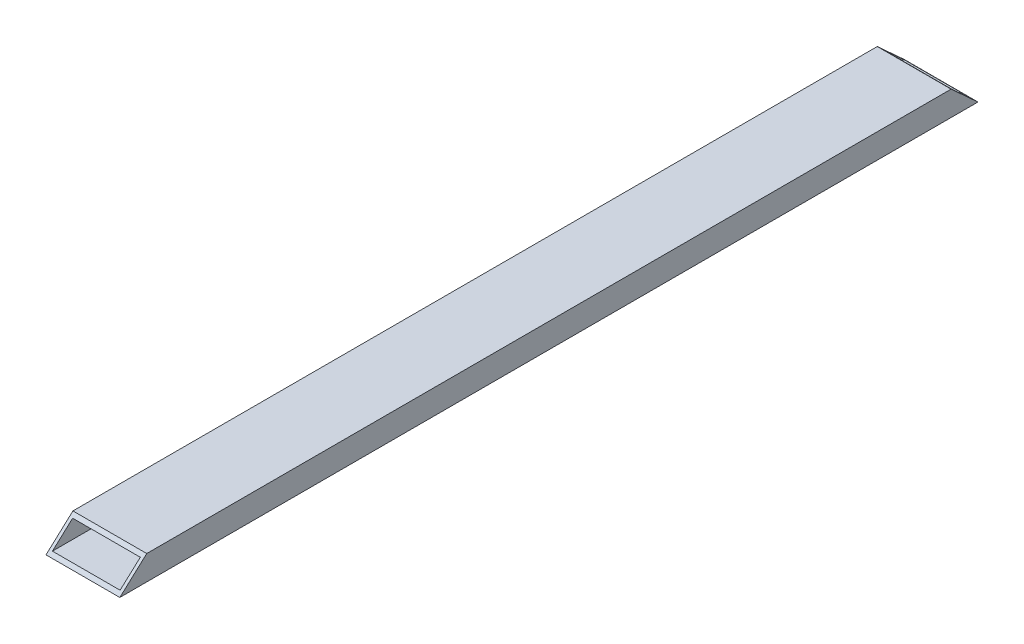
ISO-10303-21;
HEADER;
FILE_DESCRIPTION(('STEP AP214'),'2;1');
FILE_NAME('part.step','',(''),(''),'','','');
FILE_SCHEMA(('AUTOMOTIVE_DESIGN { 1 0 10303 214 1 1 1 1 }'));
ENDSEC;
DATA;
#1=APPLICATION_CONTEXT('core data for automotive mechanical design processes');
#2=APPLICATION_PROTOCOL_DEFINITION('international standard','automotive_design',2000,#1);
#3=PRODUCT_CONTEXT('',#1,'mechanical');
#4=PRODUCT('Part','Part','',(#3));
#5=PRODUCT_RELATED_PRODUCT_CATEGORY('part','',(#4));
#6=PRODUCT_DEFINITION_FORMATION('','',#4);
#7=PRODUCT_DEFINITION_CONTEXT('part definition',#1,'design');
#8=PRODUCT_DEFINITION('design','',#6,#7);
#9=PRODUCT_DEFINITION_SHAPE('','',#8);
#10=(LENGTH_UNIT() NAMED_UNIT(*) SI_UNIT(.MILLI.,.METRE.));
#11=(NAMED_UNIT(*) PLANE_ANGLE_UNIT() SI_UNIT($,.RADIAN.));
#12=(NAMED_UNIT(*) SI_UNIT($,.STERADIAN.) SOLID_ANGLE_UNIT());
#13=UNCERTAINTY_MEASURE_WITH_UNIT(LENGTH_MEASURE(1.E-05),#10,'distance_accuracy_value','');
#14=(GEOMETRIC_REPRESENTATION_CONTEXT(3) GLOBAL_UNCERTAINTY_ASSIGNED_CONTEXT((#13)) GLOBAL_UNIT_ASSIGNED_CONTEXT((#10,
#11,#12)) REPRESENTATION_CONTEXT('',''));
#15=CARTESIAN_POINT('',(0.,0.,0.));
#16=DIRECTION('',(0.,0.,1.));
#17=DIRECTION('',(1.,0.,0.));
#18=AXIS2_PLACEMENT_3D('',#15,#16,#17);
#19=CARTESIAN_POINT('',(-34.925,-9.525,457.2));
#20=DIRECTION('',(1.,0.,0.));
#21=DIRECTION('',(0.,1.,0.));
#22=AXIS2_PLACEMENT_3D('',#19,#20,#21);
#23=PLANE('',#22);
#24=DIRECTION('',(0.,0.,-1.));
#25=VECTOR('',#24,1.);
#26=CARTESIAN_POINT('',(-34.925,9.52499999999999,457.2));
#27=LINE('',#26,#25);
#28=CARTESIAN_POINT('',(-34.925,9.52499999999999,418.60390625));
#29=VERTEX_POINT('',#28);
#30=CARTESIAN_POINT('',(-34.925,9.525,-418.60390625));
#31=VERTEX_POINT('',#30);
#32=EDGE_CURVE('E166',#29,#31,#27,.T.);
#33=ORIENTED_EDGE('',*,*,#32,.F.);
#34=DIRECTION('',(0.,-0.674769199544935,0.738028812002274));
#35=VECTOR('',#34,1.);
#36=CARTESIAN_POINT('',(-34.925,-18.3695420186749,449.113561582926));
#37=LINE('',#36,#35);
#38=CARTESIAN_POINT('',(-34.925,-9.52499999999999,439.43984375));
#39=VERTEX_POINT('',#38);
#40=EDGE_CURVE('E11',#29,#39,#37,.T.);
#41=ORIENTED_EDGE('',*,*,#40,.T.);
#42=DIRECTION('',(0.,0.,-1.));
#43=VECTOR('',#42,1.);
#44=CARTESIAN_POINT('',(-34.925,-9.525,457.2));
#45=LINE('',#44,#43);
#46=CARTESIAN_POINT('',(-34.925,-9.52499999999995,-439.43984375));
#47=VERTEX_POINT('',#46);
#48=EDGE_CURVE('E158',#39,#47,#45,.T.);
#49=ORIENTED_EDGE('',*,*,#48,.T.);
#50=DIRECTION('',(0.,-0.674769199544934,-0.738028812002275));
#51=VECTOR('',#50,1.);
#52=CARTESIAN_POINT('',(-34.9250000000002,437.00084481992,48.9477990217899));
#53=LINE('',#52,#51);
#54=EDGE_CURVE('E52',#31,#47,#53,.T.);
#55=ORIENTED_EDGE('',*,*,#54,.F.);
#56=EDGE_LOOP('',(#33,#41,#49,#55));
#57=FACE_BOUND('',#56,.T.);
#58=ADVANCED_FACE('F43',(#57),#23,.T.);
#59=CARTESIAN_POINT('',(-34.925,9.52499999999999,457.2));
#60=DIRECTION('',(0.,-1.,0.));
#61=DIRECTION('',(1.,0.,0.));
#62=AXIS2_PLACEMENT_3D('',#59,#60,#61);
#63=PLANE('',#62);
#64=DIRECTION('',(0.,0.,-1.));
#65=VECTOR('',#64,1.);
#66=CARTESIAN_POINT('',(34.925,9.525,457.2));
#67=LINE('',#66,#65);
#68=CARTESIAN_POINT('',(34.925,9.525,418.60390625));
#69=VERTEX_POINT('',#68);
#70=CARTESIAN_POINT('',(34.925,9.525,-418.60390625));
#71=VERTEX_POINT('',#70);
#72=EDGE_CURVE('E171',#69,#71,#67,.T.);
#73=ORIENTED_EDGE('',*,*,#72,.F.);
#74=DIRECTION('',(-1.,0.,0.));
#75=VECTOR('',#74,1.);
#76=CARTESIAN_POINT('',(-34.925,9.52499999999999,418.60390625));
#77=LINE('',#76,#75);
#78=EDGE_CURVE('E162',#69,#29,#77,.T.);
#79=ORIENTED_EDGE('',*,*,#78,.T.);
#80=ORIENTED_EDGE('',*,*,#32,.T.);
#81=DIRECTION('',(-1.,0.,0.));
#82=VECTOR('',#81,1.);
#83=CARTESIAN_POINT('',(-34.9249999999999,9.52499999999999,-418.60390625));
#84=LINE('',#83,#82);
#85=EDGE_CURVE('E116',#71,#31,#84,.T.);
#86=ORIENTED_EDGE('',*,*,#85,.F.);
#87=EDGE_LOOP('',(#73,#79,#80,#86));
#88=FACE_BOUND('',#87,.T.);
#89=ADVANCED_FACE('F211',(#88),#63,.T.);
#90=CARTESIAN_POINT('',(34.925,9.525,457.2));
#91=DIRECTION('',(-1.,0.,0.));
#92=DIRECTION('',(0.,0.,1.));
#93=AXIS2_PLACEMENT_3D('',#90,#91,#92);
#94=PLANE('',#93);
#95=DIRECTION('',(0.,0.,-1.));
#96=VECTOR('',#95,1.);
#97=CARTESIAN_POINT('',(34.925,-9.525,457.2));
#98=LINE('',#97,#96);
#99=CARTESIAN_POINT('',(34.925,-9.525,439.43984375));
#100=VERTEX_POINT('',#99);
#101=CARTESIAN_POINT('',(34.925,-9.52499999999995,-439.43984375));
#102=VERTEX_POINT('',#101);
#103=EDGE_CURVE('E160',#100,#102,#98,.T.);
#104=ORIENTED_EDGE('',*,*,#103,.F.);
#105=DIRECTION('',(0.,0.674769199544935,-0.738028812002274));
#106=VECTOR('',#105,1.);
#107=CARTESIAN_POINT('',(34.925,-9.69582036460649,439.626678523788));
#108=LINE('',#107,#106);
#109=EDGE_CURVE('E173',#100,#69,#108,.T.);
#110=ORIENTED_EDGE('',*,*,#109,.T.);
#111=ORIENTED_EDGE('',*,*,#72,.T.);
#112=DIRECTION('',(0.,0.674769199544934,0.738028812002275));
#113=VECTOR('',#112,1.);
#114=CARTESIAN_POINT('',(34.925,445.674566473988,58.4346820809273));
#115=LINE('',#114,#113);
#116=EDGE_CURVE('E163',#102,#71,#115,.T.);
#117=ORIENTED_EDGE('',*,*,#116,.F.);
#118=EDGE_LOOP('',(#104,#110,#111,#117));
#119=FACE_BOUND('',#118,.T.);
#120=ADVANCED_FACE('F208',(#119),#94,.T.);
#121=CARTESIAN_POINT('',(34.925,-9.525,457.2));
#122=DIRECTION('',(0.,1.,0.));
#123=DIRECTION('',(0.,0.,1.));
#124=AXIS2_PLACEMENT_3D('',#121,#122,#123);
#125=PLANE('',#124);
#126=ORIENTED_EDGE('',*,*,#48,.F.);
#127=DIRECTION('',(1.,0.,0.));
#128=VECTOR('',#127,1.);
#129=CARTESIAN_POINT('',(34.925,-9.525,439.43984375));
#130=LINE('',#129,#128);
#131=EDGE_CURVE('E167',#39,#100,#130,.T.);
#132=ORIENTED_EDGE('',*,*,#131,.T.);
#133=ORIENTED_EDGE('',*,*,#103,.T.);
#134=DIRECTION('',(1.,0.,0.));
#135=VECTOR('',#134,1.);
#136=CARTESIAN_POINT('',(34.925,-9.525,-439.43984375));
#137=LINE('',#136,#135);
#138=EDGE_CURVE('E146',#47,#102,#137,.T.);
#139=ORIENTED_EDGE('',*,*,#138,.F.);
#140=EDGE_LOOP('',(#126,#132,#133,#139));
#141=FACE_BOUND('',#140,.T.);
#142=ADVANCED_FACE('F156',(#141),#125,.T.);
#143=CARTESIAN_POINT('',(-38.1,213.652512227657,-195.339439750999));
#144=DIRECTION('',(0.,-0.738028812002275,0.674769199544934));
#145=DIRECTION('',(0.,-0.674769199544934,-0.738028812002275));
#146=AXIS2_PLACEMENT_3D('',#143,#144,#145);
#147=PLANE('',#146);
#148=ORIENTED_EDGE('',*,*,#138,.T.);
#149=ORIENTED_EDGE('',*,*,#116,.T.);
#150=ORIENTED_EDGE('',*,*,#85,.T.);
#151=ORIENTED_EDGE('',*,*,#54,.T.);
#152=EDGE_LOOP('',(#148,#149,#150,#151));
#153=FACE_BOUND('',#152,.T.);
#154=DIRECTION('',(0.,-0.674769199544934,-0.738028812002275));
#155=VECTOR('',#154,1.);
#156=CARTESIAN_POINT('',(38.1,213.652512227657,-195.339439750999));
#157=LINE('',#156,#155);
#158=CARTESIAN_POINT('',(38.1,12.7,-415.13125));
#159=VERTEX_POINT('',#158);
#160=CARTESIAN_POINT('',(38.1,-12.7,-442.9125));
#161=VERTEX_POINT('',#160);
#162=EDGE_CURVE('E67',#159,#161,#157,.T.);
#163=ORIENTED_EDGE('',*,*,#162,.T.);
#164=DIRECTION('',(1.,0.,0.));
#165=VECTOR('',#164,1.);
#166=CARTESIAN_POINT('',(-38.1,-12.7,-442.9125));
#167=LINE('',#166,#165);
#168=CARTESIAN_POINT('',(-38.1,-12.7,-442.9125));
#169=VERTEX_POINT('',#168);
#170=EDGE_CURVE('E187',#169,#161,#167,.T.);
#171=ORIENTED_EDGE('',*,*,#170,.F.);
#172=DIRECTION('',(0.,-0.674769199544934,-0.738028812002275));
#173=VECTOR('',#172,1.);
#174=CARTESIAN_POINT('',(-38.1,213.652512227657,-195.339439750999));
#175=LINE('',#174,#173);
#176=CARTESIAN_POINT('',(-38.1,12.7,-415.13125));
#177=VERTEX_POINT('',#176);
#178=EDGE_CURVE('E193',#177,#169,#175,.T.);
#179=ORIENTED_EDGE('',*,*,#178,.F.);
#180=DIRECTION('',(1.,0.,0.));
#181=VECTOR('',#180,1.);
#182=CARTESIAN_POINT('',(-38.1,12.7,-415.13125));
#183=LINE('',#182,#181);
#184=EDGE_CURVE('E131',#177,#159,#183,.T.);
#185=ORIENTED_EDGE('',*,*,#184,.T.);
#186=EDGE_LOOP('',(#163,#171,#179,#185));
#187=FACE_BOUND('',#186,.T.);
#188=ADVANCED_FACE('F145',(#153,#187),#147,.F.);
#189=CARTESIAN_POINT('',(-38.1,213.652512227657,195.339439751));
#190=DIRECTION('',(0.,0.738028812002274,0.674769199544935));
#191=DIRECTION('',(0.,-0.674769199544935,0.738028812002274));
#192=AXIS2_PLACEMENT_3D('',#189,#190,#191);
#193=PLANE('',#192);
#194=ORIENTED_EDGE('',*,*,#40,.F.);
#195=ORIENTED_EDGE('',*,*,#78,.F.);
#196=ORIENTED_EDGE('',*,*,#109,.F.);
#197=ORIENTED_EDGE('',*,*,#131,.F.);
#198=EDGE_LOOP('',(#194,#195,#196,#197));
#199=FACE_BOUND('',#198,.T.);
#200=DIRECTION('',(0.,-0.674769199544935,0.738028812002274));
#201=VECTOR('',#200,1.);
#202=CARTESIAN_POINT('',(38.1,213.652512227657,195.339439751));
#203=LINE('',#202,#201);
#204=CARTESIAN_POINT('',(38.1,12.7,415.13125));
#205=VERTEX_POINT('',#204);
#206=CARTESIAN_POINT('',(38.1,-12.7,442.9125));
#207=VERTEX_POINT('',#206);
#208=EDGE_CURVE('E110',#205,#207,#203,.T.);
#209=ORIENTED_EDGE('',*,*,#208,.F.);
#210=DIRECTION('',(1.,0.,0.));
#211=VECTOR('',#210,1.);
#212=CARTESIAN_POINT('',(-38.1,12.7,415.13125));
#213=LINE('',#212,#211);
#214=CARTESIAN_POINT('',(-38.1,12.7,415.13125));
#215=VERTEX_POINT('',#214);
#216=EDGE_CURVE('E107',#215,#205,#213,.T.);
#217=ORIENTED_EDGE('',*,*,#216,.F.);
#218=DIRECTION('',(0.,-0.674769199544935,0.738028812002274));
#219=VECTOR('',#218,1.);
#220=CARTESIAN_POINT('',(-38.1,213.652512227657,195.339439751));
#221=LINE('',#220,#219);
#222=CARTESIAN_POINT('',(-38.1,-12.7,442.9125));
#223=VERTEX_POINT('',#222);
#224=EDGE_CURVE('E59',#215,#223,#221,.T.);
#225=ORIENTED_EDGE('',*,*,#224,.T.);
#226=DIRECTION('',(1.,0.,0.));
#227=VECTOR('',#226,1.);
#228=CARTESIAN_POINT('',(-38.1,-12.7,442.9125));
#229=LINE('',#228,#227);
#230=EDGE_CURVE('E117',#223,#207,#229,.T.);
#231=ORIENTED_EDGE('',*,*,#230,.T.);
#232=EDGE_LOOP('',(#209,#217,#225,#231));
#233=FACE_BOUND('',#232,.T.);
#234=ADVANCED_FACE('F108',(#199,#233),#193,.T.);
#235=CARTESIAN_POINT('',(38.1,-12.7,457.2));
#236=DIRECTION('',(-1.,0.,0.));
#237=DIRECTION('',(0.,0.,1.));
#238=AXIS2_PLACEMENT_3D('',#235,#236,#237);
#239=PLANE('',#238);
#240=ORIENTED_EDGE('',*,*,#208,.T.);
#241=DIRECTION('',(0.,0.,-1.));
#242=VECTOR('',#241,1.);
#243=CARTESIAN_POINT('',(38.1,-12.7,457.2));
#244=LINE('',#243,#242);
#245=EDGE_CURVE('E138',#207,#161,#244,.T.);
#246=ORIENTED_EDGE('',*,*,#245,.T.);
#247=ORIENTED_EDGE('',*,*,#162,.F.);
#248=DIRECTION('',(0.,0.,-1.));
#249=VECTOR('',#248,1.);
#250=CARTESIAN_POINT('',(38.1,12.7,457.2));
#251=LINE('',#250,#249);
#252=EDGE_CURVE('E133',#205,#159,#251,.T.);
#253=ORIENTED_EDGE('',*,*,#252,.F.);
#254=EDGE_LOOP('',(#240,#246,#247,#253));
#255=FACE_BOUND('',#254,.T.);
#256=ADVANCED_FACE('F45',(#255),#239,.F.);
#257=CARTESIAN_POINT('',(38.1,12.7,457.2));
#258=DIRECTION('',(0.,-1.,0.));
#259=DIRECTION('',(0.,0.,-1.));
#260=AXIS2_PLACEMENT_3D('',#257,#258,#259);
#261=PLANE('',#260);
#262=ORIENTED_EDGE('',*,*,#216,.T.);
#263=ORIENTED_EDGE('',*,*,#252,.T.);
#264=ORIENTED_EDGE('',*,*,#184,.F.);
#265=DIRECTION('',(0.,0.,-1.));
#266=VECTOR('',#265,1.);
#267=CARTESIAN_POINT('',(-38.1,12.7,457.2));
#268=LINE('',#267,#266);
#269=EDGE_CURVE('E124',#215,#177,#268,.T.);
#270=ORIENTED_EDGE('',*,*,#269,.F.);
#271=EDGE_LOOP('',(#262,#263,#264,#270));
#272=FACE_BOUND('',#271,.T.);
#273=ADVANCED_FACE('F130',(#272),#261,.F.);
#274=CARTESIAN_POINT('',(-38.1,12.7,457.2));
#275=DIRECTION('',(1.,0.,0.));
#276=DIRECTION('',(0.,0.,-1.));
#277=AXIS2_PLACEMENT_3D('',#274,#275,#276);
#278=PLANE('',#277);
#279=ORIENTED_EDGE('',*,*,#224,.F.);
#280=ORIENTED_EDGE('',*,*,#269,.T.);
#281=ORIENTED_EDGE('',*,*,#178,.T.);
#282=DIRECTION('',(0.,0.,-1.));
#283=VECTOR('',#282,1.);
#284=CARTESIAN_POINT('',(-38.1,-12.7,457.2));
#285=LINE('',#284,#283);
#286=EDGE_CURVE('E126',#223,#169,#285,.T.);
#287=ORIENTED_EDGE('',*,*,#286,.F.);
#288=EDGE_LOOP('',(#279,#280,#281,#287));
#289=FACE_BOUND('',#288,.T.);
#290=ADVANCED_FACE('F122',(#289),#278,.F.);
#291=CARTESIAN_POINT('',(-38.1,-12.7,457.2));
#292=DIRECTION('',(0.,1.,0.));
#293=DIRECTION('',(0.,0.,1.));
#294=AXIS2_PLACEMENT_3D('',#291,#292,#293);
#295=PLANE('',#294);
#296=ORIENTED_EDGE('',*,*,#230,.F.);
#297=ORIENTED_EDGE('',*,*,#286,.T.);
#298=ORIENTED_EDGE('',*,*,#170,.T.);
#299=ORIENTED_EDGE('',*,*,#245,.F.);
#300=EDGE_LOOP('',(#296,#297,#298,#299));
#301=FACE_BOUND('',#300,.T.);
#302=ADVANCED_FACE('F186',(#301),#295,.F.);
#303=CLOSED_SHELL('',(#58,#89,#120,#142,#188,#234,#256,#273,#290,#302));
#304=MANIFOLD_SOLID_BREP('B2',#303);
#305=ADVANCED_BREP_SHAPE_REPRESENTATION('',(#18,#304),#14);
#306=SHAPE_DEFINITION_REPRESENTATION(#9,#305);
ENDSEC;
END-ISO-10303-21;
